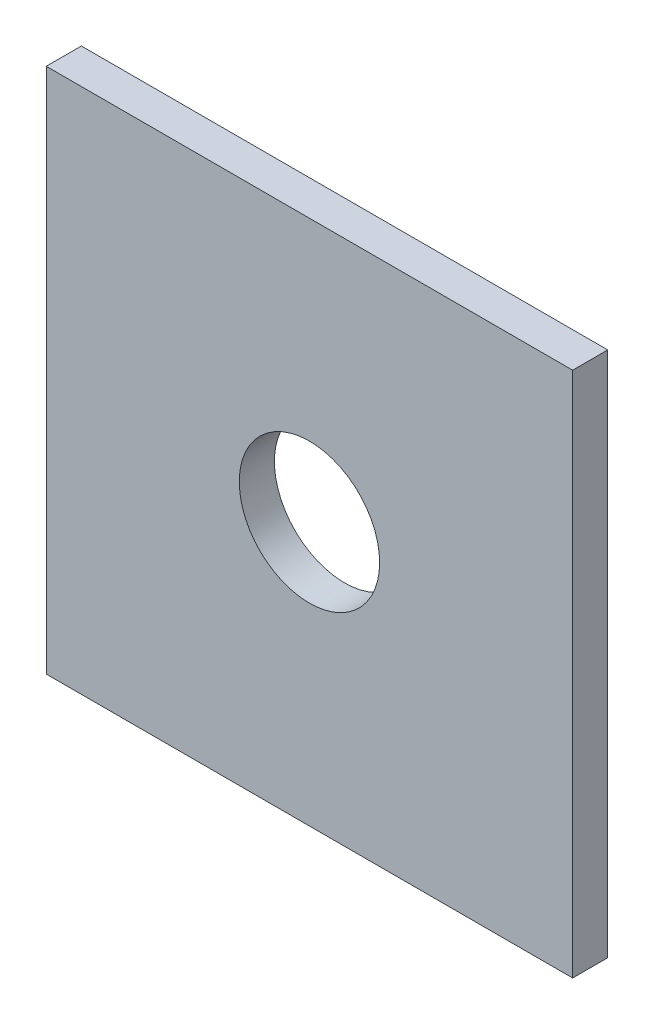
ISO-10303-21;
HEADER;
FILE_DESCRIPTION(('STEP AP214'),'2;1');
FILE_NAME('part.step','',(''),(''),'','','');
FILE_SCHEMA(('AUTOMOTIVE_DESIGN { 1 0 10303 214 1 1 1 1 }'));
ENDSEC;
DATA;
#1=APPLICATION_CONTEXT('core data for automotive mechanical design processes');
#2=APPLICATION_PROTOCOL_DEFINITION('international standard','automotive_design',2000,#1);
#3=PRODUCT_CONTEXT('',#1,'mechanical');
#4=PRODUCT('Part','Part','',(#3));
#5=PRODUCT_RELATED_PRODUCT_CATEGORY('part','',(#4));
#6=PRODUCT_DEFINITION_FORMATION('','',#4);
#7=PRODUCT_DEFINITION_CONTEXT('part definition',#1,'design');
#8=PRODUCT_DEFINITION('design','',#6,#7);
#9=PRODUCT_DEFINITION_SHAPE('','',#8);
#10=(LENGTH_UNIT() NAMED_UNIT(*) SI_UNIT(.MILLI.,.METRE.));
#11=(NAMED_UNIT(*) PLANE_ANGLE_UNIT() SI_UNIT($,.RADIAN.));
#12=(NAMED_UNIT(*) SI_UNIT($,.STERADIAN.) SOLID_ANGLE_UNIT());
#13=UNCERTAINTY_MEASURE_WITH_UNIT(LENGTH_MEASURE(1.E-05),#10,'distance_accuracy_value','');
#14=(GEOMETRIC_REPRESENTATION_CONTEXT(3) GLOBAL_UNCERTAINTY_ASSIGNED_CONTEXT((#13)) GLOBAL_UNIT_ASSIGNED_CONTEXT((#10,
#11,#12)) REPRESENTATION_CONTEXT('',''));
#15=CARTESIAN_POINT('',(0.,0.,0.));
#16=DIRECTION('',(0.,0.,1.));
#17=DIRECTION('',(1.,0.,0.));
#18=AXIS2_PLACEMENT_3D('',#15,#16,#17);
#19=CARTESIAN_POINT('',(0.,0.,1.5875));
#20=DIRECTION('',(0.,0.,-1.));
#21=DIRECTION('',(-1.,0.,0.));
#22=AXIS2_PLACEMENT_3D('',#19,#20,#21);
#23=PLANE('',#22);
#24=DIRECTION('',(0.,1.,0.));
#25=VECTOR('',#24,1.);
#26=CARTESIAN_POINT('',(11.90625,-11.90625,1.5875));
#27=LINE('',#26,#25);
#28=CARTESIAN_POINT('',(11.90625,-11.90625,1.5875));
#29=VERTEX_POINT('',#28);
#30=CARTESIAN_POINT('',(11.90625,11.90625,1.5875));
#31=VERTEX_POINT('',#30);
#32=EDGE_CURVE('E85',#29,#31,#27,.T.);
#33=ORIENTED_EDGE('',*,*,#32,.T.);
#34=DIRECTION('',(-1.,0.,0.));
#35=VECTOR('',#34,1.);
#36=CARTESIAN_POINT('',(-11.90625,11.90625,1.5875));
#37=LINE('',#36,#35);
#38=CARTESIAN_POINT('',(-11.90625,11.90625,1.5875));
#39=VERTEX_POINT('',#38);
#40=EDGE_CURVE('E80',#31,#39,#37,.T.);
#41=ORIENTED_EDGE('',*,*,#40,.T.);
#42=DIRECTION('',(0.,-1.,0.));
#43=VECTOR('',#42,1.);
#44=CARTESIAN_POINT('',(-11.90625,-11.90625,1.5875));
#45=LINE('',#44,#43);
#46=CARTESIAN_POINT('',(-11.90625,-11.90625,1.5875));
#47=VERTEX_POINT('',#46);
#48=EDGE_CURVE('E83',#39,#47,#45,.T.);
#49=ORIENTED_EDGE('',*,*,#48,.T.);
#50=DIRECTION('',(1.,0.,0.));
#51=VECTOR('',#50,1.);
#52=CARTESIAN_POINT('',(-11.90625,-11.90625,1.5875));
#53=LINE('',#52,#51);
#54=EDGE_CURVE('E50',#47,#29,#53,.T.);
#55=ORIENTED_EDGE('',*,*,#54,.T.);
#56=EDGE_LOOP('',(#33,#41,#49,#55));
#57=FACE_BOUND('',#56,.T.);
#58=CARTESIAN_POINT('',(0.,0.,1.5875));
#59=DIRECTION('',(0.,0.,1.));
#60=DIRECTION('',(1.,0.,0.));
#61=AXIS2_PLACEMENT_3D('',#58,#59,#60);
#62=CIRCLE('',#61,3.175);
#63=CARTESIAN_POINT('',(3.175,0.,1.5875));
#64=VERTEX_POINT('',#63);
#65=EDGE_CURVE('E100',#64,#64,#62,.T.);
#66=ORIENTED_EDGE('',*,*,#65,.F.);
#67=EDGE_LOOP('',(#66));
#68=FACE_BOUND('',#67,.T.);
#69=ADVANCED_FACE('F33',(#57,#68),#23,.F.);
#70=CARTESIAN_POINT('',(0.,0.,0.));
#71=DIRECTION('',(0.,0.,-1.));
#72=DIRECTION('',(-1.,0.,0.));
#73=AXIS2_PLACEMENT_3D('',#70,#71,#72);
#74=PLANE('',#73);
#75=DIRECTION('',(0.,1.,0.));
#76=VECTOR('',#75,1.);
#77=CARTESIAN_POINT('',(11.90625,-11.90625,0.));
#78=LINE('',#77,#76);
#79=CARTESIAN_POINT('',(11.90625,-11.90625,0.));
#80=VERTEX_POINT('',#79);
#81=CARTESIAN_POINT('',(11.90625,11.90625,0.));
#82=VERTEX_POINT('',#81);
#83=EDGE_CURVE('E97',#80,#82,#78,.T.);
#84=ORIENTED_EDGE('',*,*,#83,.F.);
#85=DIRECTION('',(1.,0.,0.));
#86=VECTOR('',#85,1.);
#87=CARTESIAN_POINT('',(-11.90625,-11.90625,0.));
#88=LINE('',#87,#86);
#89=CARTESIAN_POINT('',(-11.90625,-11.90625,0.));
#90=VERTEX_POINT('',#89);
#91=EDGE_CURVE('E73',#90,#80,#88,.T.);
#92=ORIENTED_EDGE('',*,*,#91,.F.);
#93=DIRECTION('',(0.,-1.,0.));
#94=VECTOR('',#93,1.);
#95=CARTESIAN_POINT('',(-11.90625,-11.90625,0.));
#96=LINE('',#95,#94);
#97=CARTESIAN_POINT('',(-11.90625,11.90625,0.));
#98=VERTEX_POINT('',#97);
#99=EDGE_CURVE('E67',#98,#90,#96,.T.);
#100=ORIENTED_EDGE('',*,*,#99,.F.);
#101=DIRECTION('',(-1.,0.,0.));
#102=VECTOR('',#101,1.);
#103=CARTESIAN_POINT('',(-11.90625,11.90625,0.));
#104=LINE('',#103,#102);
#105=EDGE_CURVE('E89',#82,#98,#104,.T.);
#106=ORIENTED_EDGE('',*,*,#105,.F.);
#107=EDGE_LOOP('',(#84,#92,#100,#106));
#108=FACE_BOUND('',#107,.T.);
#109=CARTESIAN_POINT('',(0.,0.,0.));
#110=DIRECTION('',(0.,0.,1.));
#111=DIRECTION('',(1.,0.,0.));
#112=AXIS2_PLACEMENT_3D('',#109,#110,#111);
#113=CIRCLE('',#112,3.175);
#114=CARTESIAN_POINT('',(3.175,0.,0.));
#115=VERTEX_POINT('',#114);
#116=EDGE_CURVE('E112',#115,#115,#113,.T.);
#117=ORIENTED_EDGE('',*,*,#116,.T.);
#118=EDGE_LOOP('',(#117));
#119=FACE_BOUND('',#118,.T.);
#120=ADVANCED_FACE('F108',(#108,#119),#74,.T.);
#121=CARTESIAN_POINT('',(11.90625,-11.90625,1.5875));
#122=DIRECTION('',(-1.,0.,0.));
#123=DIRECTION('',(0.,0.,1.));
#124=AXIS2_PLACEMENT_3D('',#121,#122,#123);
#125=PLANE('',#124);
#126=ORIENTED_EDGE('',*,*,#83,.T.);
#127=DIRECTION('',(0.,0.,-1.));
#128=VECTOR('',#127,1.);
#129=CARTESIAN_POINT('',(11.90625,11.90625,1.5875));
#130=LINE('',#129,#128);
#131=EDGE_CURVE('E11',#31,#82,#130,.T.);
#132=ORIENTED_EDGE('',*,*,#131,.F.);
#133=ORIENTED_EDGE('',*,*,#32,.F.);
#134=DIRECTION('',(0.,0.,-1.));
#135=VECTOR('',#134,1.);
#136=CARTESIAN_POINT('',(11.90625,-11.90625,1.5875));
#137=LINE('',#136,#135);
#138=EDGE_CURVE('E93',#29,#80,#137,.T.);
#139=ORIENTED_EDGE('',*,*,#138,.T.);
#140=EDGE_LOOP('',(#126,#132,#133,#139));
#141=FACE_BOUND('',#140,.T.);
#142=ADVANCED_FACE('F35',(#141),#125,.F.);
#143=CARTESIAN_POINT('',(-11.90625,11.90625,1.5875));
#144=DIRECTION('',(0.,-1.,0.));
#145=DIRECTION('',(0.,0.,-1.));
#146=AXIS2_PLACEMENT_3D('',#143,#144,#145);
#147=PLANE('',#146);
#148=ORIENTED_EDGE('',*,*,#105,.T.);
#149=DIRECTION('',(0.,0.,-1.));
#150=VECTOR('',#149,1.);
#151=CARTESIAN_POINT('',(-11.90625,11.90625,1.5875));
#152=LINE('',#151,#150);
#153=EDGE_CURVE('E42',#39,#98,#152,.T.);
#154=ORIENTED_EDGE('',*,*,#153,.F.);
#155=ORIENTED_EDGE('',*,*,#40,.F.);
#156=ORIENTED_EDGE('',*,*,#131,.T.);
#157=EDGE_LOOP('',(#148,#154,#155,#156));
#158=FACE_BOUND('',#157,.T.);
#159=ADVANCED_FACE('F88',(#158),#147,.F.);
#160=CARTESIAN_POINT('',(-11.90625,-11.90625,1.5875));
#161=DIRECTION('',(1.,0.,0.));
#162=DIRECTION('',(0.,0.,-1.));
#163=AXIS2_PLACEMENT_3D('',#160,#161,#162);
#164=PLANE('',#163);
#165=ORIENTED_EDGE('',*,*,#99,.T.);
#166=DIRECTION('',(0.,0.,-1.));
#167=VECTOR('',#166,1.);
#168=CARTESIAN_POINT('',(-11.90625,-11.90625,1.5875));
#169=LINE('',#168,#167);
#170=EDGE_CURVE('E90',#47,#90,#169,.T.);
#171=ORIENTED_EDGE('',*,*,#170,.F.);
#172=ORIENTED_EDGE('',*,*,#48,.F.);
#173=ORIENTED_EDGE('',*,*,#153,.T.);
#174=EDGE_LOOP('',(#165,#171,#172,#173));
#175=FACE_BOUND('',#174,.T.);
#176=ADVANCED_FACE('F91',(#175),#164,.F.);
#177=CARTESIAN_POINT('',(-11.90625,-11.90625,1.5875));
#178=DIRECTION('',(0.,1.,0.));
#179=DIRECTION('',(-1.,0.,0.));
#180=AXIS2_PLACEMENT_3D('',#177,#178,#179);
#181=PLANE('',#180);
#182=ORIENTED_EDGE('',*,*,#91,.T.);
#183=ORIENTED_EDGE('',*,*,#138,.F.);
#184=ORIENTED_EDGE('',*,*,#54,.F.);
#185=ORIENTED_EDGE('',*,*,#170,.T.);
#186=EDGE_LOOP('',(#182,#183,#184,#185));
#187=FACE_BOUND('',#186,.T.);
#188=ADVANCED_FACE('F105',(#187),#181,.F.);
#189=CARTESIAN_POINT('',(0.,0.,1.5875));
#190=DIRECTION('',(0.,0.,-1.));
#191=DIRECTION('',(-1.,0.,0.));
#192=AXIS2_PLACEMENT_3D('',#189,#190,#191);
#193=CYLINDRICAL_SURFACE('',#192,3.175);
#194=ORIENTED_EDGE('',*,*,#65,.T.);
#195=EDGE_LOOP('',(#194));
#196=FACE_BOUND('',#195,.T.);
#197=ORIENTED_EDGE('',*,*,#116,.F.);
#198=EDGE_LOOP('',(#197));
#199=FACE_BOUND('',#198,.T.);
#200=ADVANCED_FACE('F118',(#196,#199),#193,.F.);
#201=CLOSED_SHELL('',(#69,#120,#142,#159,#176,#188,#200));
#202=MANIFOLD_SOLID_BREP('B2',#201);
#203=ADVANCED_BREP_SHAPE_REPRESENTATION('',(#18,#202),#14);
#204=SHAPE_DEFINITION_REPRESENTATION(#9,#203);
ENDSEC;
END-ISO-10303-21;
